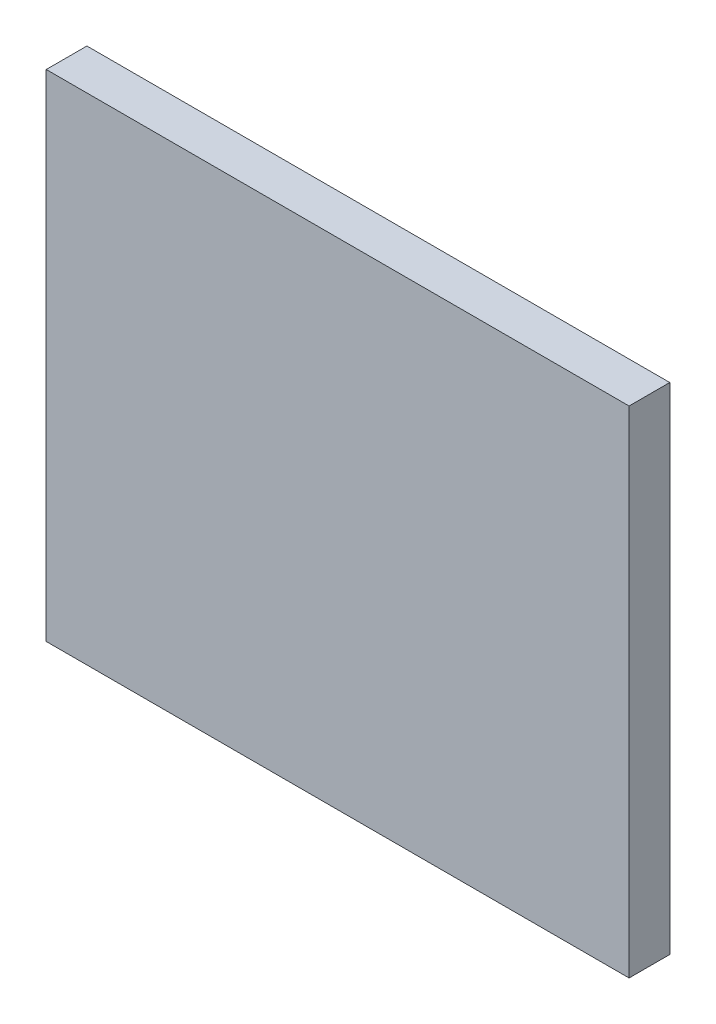
ISO-10303-21;
HEADER;
FILE_DESCRIPTION(('STEP AP214'),'2;1');
FILE_NAME('part.step','',(''),(''),'','','');
FILE_SCHEMA(('AUTOMOTIVE_DESIGN { 1 0 10303 214 1 1 1 1 }'));
ENDSEC;
DATA;
#1=APPLICATION_CONTEXT('core data for automotive mechanical design processes');
#2=APPLICATION_PROTOCOL_DEFINITION('international standard','automotive_design',2000,#1);
#3=PRODUCT_CONTEXT('',#1,'mechanical');
#4=PRODUCT('Part','Part','',(#3));
#5=PRODUCT_RELATED_PRODUCT_CATEGORY('part','',(#4));
#6=PRODUCT_DEFINITION_FORMATION('','',#4);
#7=PRODUCT_DEFINITION_CONTEXT('part definition',#1,'design');
#8=PRODUCT_DEFINITION('design','',#6,#7);
#9=PRODUCT_DEFINITION_SHAPE('','',#8);
#10=(LENGTH_UNIT() NAMED_UNIT(*) SI_UNIT(.MILLI.,.METRE.));
#11=(NAMED_UNIT(*) PLANE_ANGLE_UNIT() SI_UNIT($,.RADIAN.));
#12=(NAMED_UNIT(*) SI_UNIT($,.STERADIAN.) SOLID_ANGLE_UNIT());
#13=UNCERTAINTY_MEASURE_WITH_UNIT(LENGTH_MEASURE(1.E-05),#10,'distance_accuracy_value','');
#14=(GEOMETRIC_REPRESENTATION_CONTEXT(3) GLOBAL_UNCERTAINTY_ASSIGNED_CONTEXT((#13)) GLOBAL_UNIT_ASSIGNED_CONTEXT((#10,
#11,#12)) REPRESENTATION_CONTEXT('',''));
#15=CARTESIAN_POINT('',(0.,0.,0.));
#16=DIRECTION('',(0.,0.,1.));
#17=DIRECTION('',(1.,0.,0.));
#18=AXIS2_PLACEMENT_3D('',#15,#16,#17);
#19=CARTESIAN_POINT('',(0.,0.,2.79));
#20=DIRECTION('',(1.,0.,0.));
#21=DIRECTION('',(0.,0.,-1.));
#22=AXIS2_PLACEMENT_3D('',#19,#20,#21);
#23=PLANE('',#22);
#24=DIRECTION('',(0.,-1.,0.));
#25=VECTOR('',#24,1.);
#26=CARTESIAN_POINT('',(0.,0.,0.));
#27=LINE('',#26,#25);
#28=CARTESIAN_POINT('',(0.,33.98,0.));
#29=VERTEX_POINT('',#28);
#30=CARTESIAN_POINT('',(0.,0.,0.));
#31=VERTEX_POINT('',#30);
#32=EDGE_CURVE('E97',#29,#31,#27,.T.);
#33=ORIENTED_EDGE('',*,*,#32,.T.);
#34=DIRECTION('',(0.,0.,-1.));
#35=VECTOR('',#34,1.);
#36=CARTESIAN_POINT('',(0.,0.,2.79));
#37=LINE('',#36,#35);
#38=CARTESIAN_POINT('',(0.,0.,2.79));
#39=VERTEX_POINT('',#38);
#40=EDGE_CURVE('E11',#39,#31,#37,.T.);
#41=ORIENTED_EDGE('',*,*,#40,.F.);
#42=DIRECTION('',(0.,-1.,0.));
#43=VECTOR('',#42,1.);
#44=CARTESIAN_POINT('',(0.,0.,2.79));
#45=LINE('',#44,#43);
#46=CARTESIAN_POINT('',(0.,33.98,2.79));
#47=VERTEX_POINT('',#46);
#48=EDGE_CURVE('E85',#47,#39,#45,.T.);
#49=ORIENTED_EDGE('',*,*,#48,.F.);
#50=DIRECTION('',(0.,0.,-1.));
#51=VECTOR('',#50,1.);
#52=CARTESIAN_POINT('',(0.,33.98,2.79));
#53=LINE('',#52,#51);
#54=EDGE_CURVE('E93',#47,#29,#53,.T.);
#55=ORIENTED_EDGE('',*,*,#54,.T.);
#56=EDGE_LOOP('',(#33,#41,#49,#55));
#57=FACE_BOUND('',#56,.T.);
#58=ADVANCED_FACE('F34',(#57),#23,.F.);
#59=CARTESIAN_POINT('',(0.,0.,2.79));
#60=DIRECTION('',(0.,1.,0.));
#61=DIRECTION('',(0.,0.,1.));
#62=AXIS2_PLACEMENT_3D('',#59,#60,#61);
#63=PLANE('',#62);
#64=DIRECTION('',(1.,0.,0.));
#65=VECTOR('',#64,1.);
#66=CARTESIAN_POINT('',(0.,0.,0.));
#67=LINE('',#66,#65);
#68=CARTESIAN_POINT('',(39.98,0.,0.));
#69=VERTEX_POINT('',#68);
#70=EDGE_CURVE('E89',#31,#69,#67,.T.);
#71=ORIENTED_EDGE('',*,*,#70,.T.);
#72=DIRECTION('',(0.,0.,-1.));
#73=VECTOR('',#72,1.);
#74=CARTESIAN_POINT('',(39.98,0.,2.79));
#75=LINE('',#74,#73);
#76=CARTESIAN_POINT('',(39.98,0.,2.79));
#77=VERTEX_POINT('',#76);
#78=EDGE_CURVE('E42',#77,#69,#75,.T.);
#79=ORIENTED_EDGE('',*,*,#78,.F.);
#80=DIRECTION('',(1.,0.,0.));
#81=VECTOR('',#80,1.);
#82=CARTESIAN_POINT('',(0.,0.,2.79));
#83=LINE('',#82,#81);
#84=EDGE_CURVE('E80',#39,#77,#83,.T.);
#85=ORIENTED_EDGE('',*,*,#84,.F.);
#86=ORIENTED_EDGE('',*,*,#40,.T.);
#87=EDGE_LOOP('',(#71,#79,#85,#86));
#88=FACE_BOUND('',#87,.T.);
#89=ADVANCED_FACE('F88',(#88),#63,.F.);
#90=CARTESIAN_POINT('',(39.98,0.,2.79));
#91=DIRECTION('',(-1.,0.,0.));
#92=DIRECTION('',(0.,0.,1.));
#93=AXIS2_PLACEMENT_3D('',#90,#91,#92);
#94=PLANE('',#93);
#95=DIRECTION('',(0.,1.,0.));
#96=VECTOR('',#95,1.);
#97=CARTESIAN_POINT('',(39.98,0.,0.));
#98=LINE('',#97,#96);
#99=CARTESIAN_POINT('',(39.98,33.98,0.));
#100=VERTEX_POINT('',#99);
#101=EDGE_CURVE('E67',#69,#100,#98,.T.);
#102=ORIENTED_EDGE('',*,*,#101,.T.);
#103=DIRECTION('',(0.,0.,-1.));
#104=VECTOR('',#103,1.);
#105=CARTESIAN_POINT('',(39.98,33.98,2.79));
#106=LINE('',#105,#104);
#107=CARTESIAN_POINT('',(39.98,33.98,2.79));
#108=VERTEX_POINT('',#107);
#109=EDGE_CURVE('E90',#108,#100,#106,.T.);
#110=ORIENTED_EDGE('',*,*,#109,.F.);
#111=DIRECTION('',(0.,1.,0.));
#112=VECTOR('',#111,1.);
#113=CARTESIAN_POINT('',(39.98,0.,2.79));
#114=LINE('',#113,#112);
#115=EDGE_CURVE('E83',#77,#108,#114,.T.);
#116=ORIENTED_EDGE('',*,*,#115,.F.);
#117=ORIENTED_EDGE('',*,*,#78,.T.);
#118=EDGE_LOOP('',(#102,#110,#116,#117));
#119=FACE_BOUND('',#118,.T.);
#120=ADVANCED_FACE('F91',(#119),#94,.F.);
#121=CARTESIAN_POINT('',(0.,33.98,2.79));
#122=DIRECTION('',(0.,-1.,0.));
#123=DIRECTION('',(0.,0.,-1.));
#124=AXIS2_PLACEMENT_3D('',#121,#122,#123);
#125=PLANE('',#124);
#126=DIRECTION('',(-1.,0.,0.));
#127=VECTOR('',#126,1.);
#128=CARTESIAN_POINT('',(0.,33.98,0.));
#129=LINE('',#128,#127);
#130=EDGE_CURVE('E73',#100,#29,#129,.T.);
#131=ORIENTED_EDGE('',*,*,#130,.T.);
#132=ORIENTED_EDGE('',*,*,#54,.F.);
#133=DIRECTION('',(-1.,0.,0.));
#134=VECTOR('',#133,1.);
#135=CARTESIAN_POINT('',(0.,33.98,2.79));
#136=LINE('',#135,#134);
#137=EDGE_CURVE('E50',#108,#47,#136,.T.);
#138=ORIENTED_EDGE('',*,*,#137,.F.);
#139=ORIENTED_EDGE('',*,*,#109,.T.);
#140=EDGE_LOOP('',(#131,#132,#138,#139));
#141=FACE_BOUND('',#140,.T.);
#142=ADVANCED_FACE('F104',(#141),#125,.F.);
#143=CARTESIAN_POINT('',(0.,0.,2.79));
#144=DIRECTION('',(0.,0.,-1.));
#145=DIRECTION('',(-1.,0.,0.));
#146=AXIS2_PLACEMENT_3D('',#143,#144,#145);
#147=PLANE('',#146);
#148=ORIENTED_EDGE('',*,*,#48,.T.);
#149=ORIENTED_EDGE('',*,*,#84,.T.);
#150=ORIENTED_EDGE('',*,*,#115,.T.);
#151=ORIENTED_EDGE('',*,*,#137,.T.);
#152=EDGE_LOOP('',(#148,#149,#150,#151));
#153=FACE_BOUND('',#152,.T.);
#154=ADVANCED_FACE('F81',(#153),#147,.F.);
#155=CARTESIAN_POINT('',(0.,0.,0.));
#156=DIRECTION('',(0.,0.,-1.));
#157=DIRECTION('',(-1.,0.,0.));
#158=AXIS2_PLACEMENT_3D('',#155,#156,#157);
#159=PLANE('',#158);
#160=ORIENTED_EDGE('',*,*,#32,.F.);
#161=ORIENTED_EDGE('',*,*,#130,.F.);
#162=ORIENTED_EDGE('',*,*,#101,.F.);
#163=ORIENTED_EDGE('',*,*,#70,.F.);
#164=EDGE_LOOP('',(#160,#161,#162,#163));
#165=FACE_BOUND('',#164,.T.);
#166=ADVANCED_FACE('F107',(#165),#159,.T.);
#167=CLOSED_SHELL('',(#58,#89,#120,#142,#154,#166));
#168=MANIFOLD_SOLID_BREP('B2',#167);
#169=ADVANCED_BREP_SHAPE_REPRESENTATION('',(#18,#168),#14);
#170=SHAPE_DEFINITION_REPRESENTATION(#9,#169);
ENDSEC;
END-ISO-10303-21;
